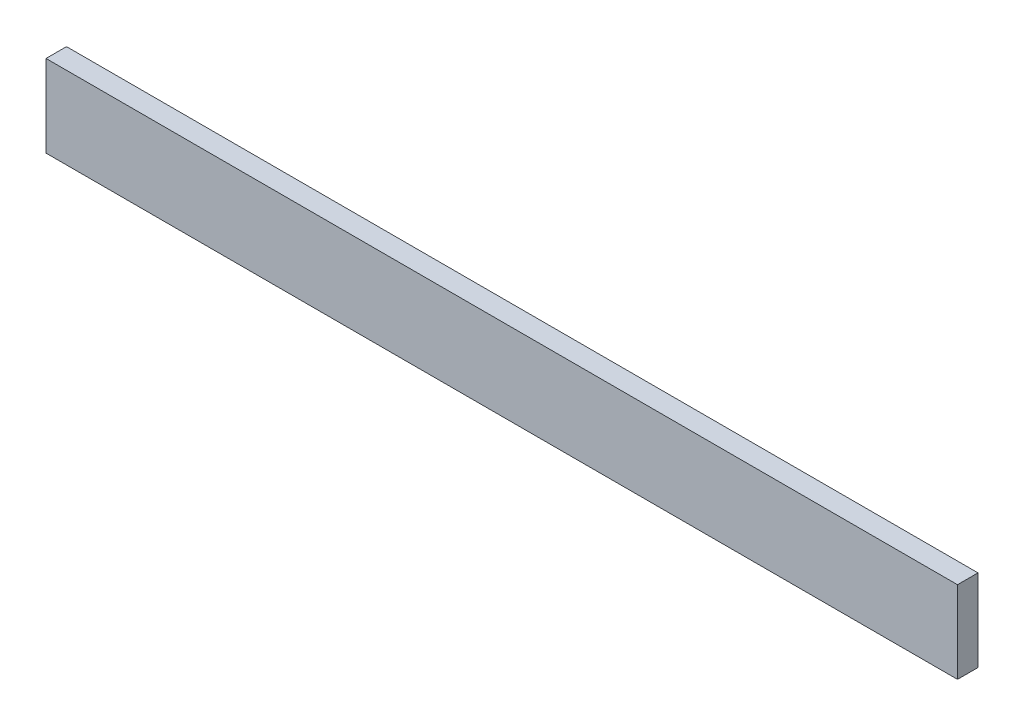
ISO-10303-21;
HEADER;
FILE_DESCRIPTION(('STEP AP214'),'2;1');
FILE_NAME('part.step','',(''),(''),'','','');
FILE_SCHEMA(('AUTOMOTIVE_DESIGN { 1 0 10303 214 1 1 1 1 }'));
ENDSEC;
DATA;
#1=APPLICATION_CONTEXT('core data for automotive mechanical design processes');
#2=APPLICATION_PROTOCOL_DEFINITION('international standard','automotive_design',2000,#1);
#3=PRODUCT_CONTEXT('',#1,'mechanical');
#4=PRODUCT('Part','Part','',(#3));
#5=PRODUCT_RELATED_PRODUCT_CATEGORY('part','',(#4));
#6=PRODUCT_DEFINITION_FORMATION('','',#4);
#7=PRODUCT_DEFINITION_CONTEXT('part definition',#1,'design');
#8=PRODUCT_DEFINITION('design','',#6,#7);
#9=PRODUCT_DEFINITION_SHAPE('','',#8);
#10=(LENGTH_UNIT() NAMED_UNIT(*) SI_UNIT(.MILLI.,.METRE.));
#11=(NAMED_UNIT(*) PLANE_ANGLE_UNIT() SI_UNIT($,.RADIAN.));
#12=(NAMED_UNIT(*) SI_UNIT($,.STERADIAN.) SOLID_ANGLE_UNIT());
#13=UNCERTAINTY_MEASURE_WITH_UNIT(LENGTH_MEASURE(1.E-05),#10,'distance_accuracy_value','');
#14=(GEOMETRIC_REPRESENTATION_CONTEXT(3) GLOBAL_UNCERTAINTY_ASSIGNED_CONTEXT((#13)) GLOBAL_UNIT_ASSIGNED_CONTEXT((#10,
#11,#12)) REPRESENTATION_CONTEXT('',''));
#15=CARTESIAN_POINT('',(0.,0.,0.));
#16=DIRECTION('',(0.,0.,1.));
#17=DIRECTION('',(1.,0.,0.));
#18=AXIS2_PLACEMENT_3D('',#15,#16,#17);
#19=CARTESIAN_POINT('',(115.640329174175,-77.4785952858985,3.175));
#20=DIRECTION('',(-1.,0.,0.));
#21=DIRECTION('',(0.,0.,1.));
#22=AXIS2_PLACEMENT_3D('',#19,#20,#21);
#23=PLANE('',#22);
#24=DIRECTION('',(0.,1.,0.));
#25=VECTOR('',#24,1.);
#26=CARTESIAN_POINT('',(115.640329174175,-77.4785952858985,0.));
#27=LINE('',#26,#25);
#28=CARTESIAN_POINT('',(115.640329174175,-77.4785952858985,0.));
#29=VERTEX_POINT('',#28);
#30=CARTESIAN_POINT('',(115.640329174175,-64.7785952858985,0.));
#31=VERTEX_POINT('',#30);
#32=EDGE_CURVE('E96',#29,#31,#27,.T.);
#33=ORIENTED_EDGE('',*,*,#32,.T.);
#34=DIRECTION('',(0.,0.,-1.));
#35=VECTOR('',#34,1.);
#36=CARTESIAN_POINT('',(115.640329174175,-64.7785952858985,3.175));
#37=LINE('',#36,#35);
#38=CARTESIAN_POINT('',(115.640329174175,-64.7785952858985,3.175));
#39=VERTEX_POINT('',#38);
#40=EDGE_CURVE('E11',#39,#31,#37,.T.);
#41=ORIENTED_EDGE('',*,*,#40,.F.);
#42=DIRECTION('',(0.,1.,0.));
#43=VECTOR('',#42,1.);
#44=CARTESIAN_POINT('',(115.640329174175,-77.4785952858985,3.175));
#45=LINE('',#44,#43);
#46=CARTESIAN_POINT('',(115.640329174175,-77.4785952858985,3.175));
#47=VERTEX_POINT('',#46);
#48=EDGE_CURVE('E84',#47,#39,#45,.T.);
#49=ORIENTED_EDGE('',*,*,#48,.F.);
#50=DIRECTION('',(0.,0.,-1.));
#51=VECTOR('',#50,1.);
#52=CARTESIAN_POINT('',(115.640329174175,-77.4785952858985,3.175));
#53=LINE('',#52,#51);
#54=EDGE_CURVE('E92',#47,#29,#53,.T.);
#55=ORIENTED_EDGE('',*,*,#54,.T.);
#56=EDGE_LOOP('',(#33,#41,#49,#55));
#57=FACE_BOUND('',#56,.T.);
#58=ADVANCED_FACE('F33',(#57),#23,.F.);
#59=CARTESIAN_POINT('',(-25.5300657034035,-64.7785952858985,3.175));
#60=DIRECTION('',(0.,-1.,0.));
#61=DIRECTION('',(0.,0.,-1.));
#62=AXIS2_PLACEMENT_3D('',#59,#60,#61);
#63=PLANE('',#62);
#64=DIRECTION('',(-1.,0.,0.));
#65=VECTOR('',#64,1.);
#66=CARTESIAN_POINT('',(-25.5300657034035,-64.7785952858985,0.));
#67=LINE('',#66,#65);
#68=CARTESIAN_POINT('',(-25.5300657034035,-64.7785952858985,0.));
#69=VERTEX_POINT('',#68);
#70=EDGE_CURVE('E88',#31,#69,#67,.T.);
#71=ORIENTED_EDGE('',*,*,#70,.T.);
#72=DIRECTION('',(0.,0.,-1.));
#73=VECTOR('',#72,1.);
#74=CARTESIAN_POINT('',(-25.5300657034035,-64.7785952858985,3.175));
#75=LINE('',#74,#73);
#76=CARTESIAN_POINT('',(-25.5300657034035,-64.7785952858985,3.175));
#77=VERTEX_POINT('',#76);
#78=EDGE_CURVE('E41',#77,#69,#75,.T.);
#79=ORIENTED_EDGE('',*,*,#78,.F.);
#80=DIRECTION('',(-1.,0.,0.));
#81=VECTOR('',#80,1.);
#82=CARTESIAN_POINT('',(-25.5300657034035,-64.7785952858985,3.175));
#83=LINE('',#82,#81);
#84=EDGE_CURVE('E79',#39,#77,#83,.T.);
#85=ORIENTED_EDGE('',*,*,#84,.F.);
#86=ORIENTED_EDGE('',*,*,#40,.T.);
#87=EDGE_LOOP('',(#71,#79,#85,#86));
#88=FACE_BOUND('',#87,.T.);
#89=ADVANCED_FACE('F87',(#88),#63,.F.);
#90=CARTESIAN_POINT('',(-25.5300657034035,-77.4785952858985,3.175));
#91=DIRECTION('',(1.,0.,0.));
#92=DIRECTION('',(0.,0.,-1.));
#93=AXIS2_PLACEMENT_3D('',#90,#91,#92);
#94=PLANE('',#93);
#95=DIRECTION('',(0.,-1.,0.));
#96=VECTOR('',#95,1.);
#97=CARTESIAN_POINT('',(-25.5300657034035,-77.4785952858985,0.));
#98=LINE('',#97,#96);
#99=CARTESIAN_POINT('',(-25.5300657034035,-77.4785952858985,0.));
#100=VERTEX_POINT('',#99);
#101=EDGE_CURVE('E66',#69,#100,#98,.T.);
#102=ORIENTED_EDGE('',*,*,#101,.T.);
#103=DIRECTION('',(0.,0.,-1.));
#104=VECTOR('',#103,1.);
#105=CARTESIAN_POINT('',(-25.5300657034035,-77.4785952858985,3.175));
#106=LINE('',#105,#104);
#107=CARTESIAN_POINT('',(-25.5300657034035,-77.4785952858985,3.175));
#108=VERTEX_POINT('',#107);
#109=EDGE_CURVE('E89',#108,#100,#106,.T.);
#110=ORIENTED_EDGE('',*,*,#109,.F.);
#111=DIRECTION('',(0.,-1.,0.));
#112=VECTOR('',#111,1.);
#113=CARTESIAN_POINT('',(-25.5300657034035,-77.4785952858985,3.175));
#114=LINE('',#113,#112);
#115=EDGE_CURVE('E82',#77,#108,#114,.T.);
#116=ORIENTED_EDGE('',*,*,#115,.F.);
#117=ORIENTED_EDGE('',*,*,#78,.T.);
#118=EDGE_LOOP('',(#102,#110,#116,#117));
#119=FACE_BOUND('',#118,.T.);
#120=ADVANCED_FACE('F90',(#119),#94,.F.);
#121=CARTESIAN_POINT('',(-25.5300657034035,-77.4785952858985,3.175));
#122=DIRECTION('',(0.,1.,0.));
#123=DIRECTION('',(0.,0.,1.));
#124=AXIS2_PLACEMENT_3D('',#121,#122,#123);
#125=PLANE('',#124);
#126=DIRECTION('',(1.,0.,0.));
#127=VECTOR('',#126,1.);
#128=CARTESIAN_POINT('',(-25.5300657034035,-77.4785952858985,0.));
#129=LINE('',#128,#127);
#130=EDGE_CURVE('E72',#100,#29,#129,.T.);
#131=ORIENTED_EDGE('',*,*,#130,.T.);
#132=ORIENTED_EDGE('',*,*,#54,.F.);
#133=DIRECTION('',(1.,0.,0.));
#134=VECTOR('',#133,1.);
#135=CARTESIAN_POINT('',(-25.5300657034035,-77.4785952858985,3.175));
#136=LINE('',#135,#134);
#137=EDGE_CURVE('E49',#108,#47,#136,.T.);
#138=ORIENTED_EDGE('',*,*,#137,.F.);
#139=ORIENTED_EDGE('',*,*,#109,.T.);
#140=EDGE_LOOP('',(#131,#132,#138,#139));
#141=FACE_BOUND('',#140,.T.);
#142=ADVANCED_FACE('F103',(#141),#125,.F.);
#143=CARTESIAN_POINT('',(0.,0.,3.175));
#144=DIRECTION('',(0.,0.,-1.));
#145=DIRECTION('',(-1.,0.,0.));
#146=AXIS2_PLACEMENT_3D('',#143,#144,#145);
#147=PLANE('',#146);
#148=ORIENTED_EDGE('',*,*,#48,.T.);
#149=ORIENTED_EDGE('',*,*,#84,.T.);
#150=ORIENTED_EDGE('',*,*,#115,.T.);
#151=ORIENTED_EDGE('',*,*,#137,.T.);
#152=EDGE_LOOP('',(#148,#149,#150,#151));
#153=FACE_BOUND('',#152,.T.);
#154=ADVANCED_FACE('F80',(#153),#147,.F.);
#155=CARTESIAN_POINT('',(0.,0.,0.));
#156=DIRECTION('',(0.,0.,-1.));
#157=DIRECTION('',(-1.,0.,0.));
#158=AXIS2_PLACEMENT_3D('',#155,#156,#157);
#159=PLANE('',#158);
#160=ORIENTED_EDGE('',*,*,#32,.F.);
#161=ORIENTED_EDGE('',*,*,#130,.F.);
#162=ORIENTED_EDGE('',*,*,#101,.F.);
#163=ORIENTED_EDGE('',*,*,#70,.F.);
#164=EDGE_LOOP('',(#160,#161,#162,#163));
#165=FACE_BOUND('',#164,.T.);
#166=ADVANCED_FACE('F106',(#165),#159,.T.);
#167=CLOSED_SHELL('',(#58,#89,#120,#142,#154,#166));
#168=MANIFOLD_SOLID_BREP('B2',#167);
#169=ADVANCED_BREP_SHAPE_REPRESENTATION('',(#18,#168),#14);
#170=SHAPE_DEFINITION_REPRESENTATION(#9,#169);
ENDSEC;
END-ISO-10303-21;
